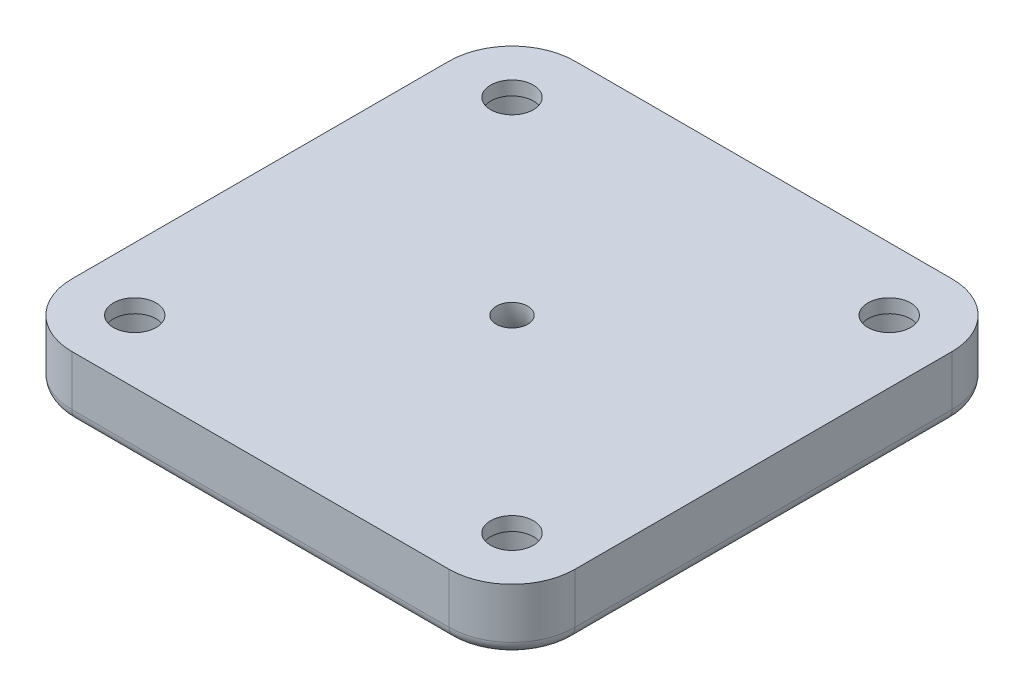
ISO-10303-21;
HEADER;
FILE_DESCRIPTION(('STEP AP214'),'2;1');
FILE_NAME('part.step','',(''),(''),'','','');
FILE_SCHEMA(('AUTOMOTIVE_DESIGN { 1 0 10303 214 1 1 1 1 }'));
ENDSEC;
DATA;
#1=APPLICATION_CONTEXT('core data for automotive mechanical design processes');
#2=APPLICATION_PROTOCOL_DEFINITION('international standard','automotive_design',2000,#1);
#3=PRODUCT_CONTEXT('',#1,'mechanical');
#4=PRODUCT('Part','Part','',(#3));
#5=PRODUCT_RELATED_PRODUCT_CATEGORY('part','',(#4));
#6=PRODUCT_DEFINITION_FORMATION('','',#4);
#7=PRODUCT_DEFINITION_CONTEXT('part definition',#1,'design');
#8=PRODUCT_DEFINITION('design','',#6,#7);
#9=PRODUCT_DEFINITION_SHAPE('','',#8);
#10=(LENGTH_UNIT() NAMED_UNIT(*) SI_UNIT(.MILLI.,.METRE.));
#11=(NAMED_UNIT(*) PLANE_ANGLE_UNIT() SI_UNIT($,.RADIAN.));
#12=(NAMED_UNIT(*) SI_UNIT($,.STERADIAN.) SOLID_ANGLE_UNIT());
#13=UNCERTAINTY_MEASURE_WITH_UNIT(LENGTH_MEASURE(1.E-05),#10,'distance_accuracy_value','');
#14=(GEOMETRIC_REPRESENTATION_CONTEXT(3) GLOBAL_UNCERTAINTY_ASSIGNED_CONTEXT((#13)) GLOBAL_UNIT_ASSIGNED_CONTEXT((#10,
#11,#12)) REPRESENTATION_CONTEXT('',''));
#15=CARTESIAN_POINT('',(0.,0.,0.));
#16=DIRECTION('',(0.,0.,1.));
#17=DIRECTION('',(1.,0.,0.));
#18=AXIS2_PLACEMENT_3D('',#15,#16,#17);
#19=CARTESIAN_POINT('',(-15.,-12.,15.));
#20=DIRECTION('',(0.,1.,0.));
#21=DIRECTION('',(0.,0.,1.));
#22=AXIS2_PLACEMENT_3D('',#19,#20,#21);
#23=CYLINDRICAL_SURFACE('',#22,1.7);
#24=CARTESIAN_POINT('',(-15.,-7.,15.));
#25=DIRECTION('',(0.,-1.,0.));
#26=DIRECTION('',(0.,0.,-1.));
#27=AXIS2_PLACEMENT_3D('',#24,#25,#26);
#28=CIRCLE('',#27,1.7);
#29=CARTESIAN_POINT('',(-15.,-7.,13.3));
#30=VERTEX_POINT('',#29);
#31=EDGE_CURVE('E143',#30,#30,#28,.T.);
#32=ORIENTED_EDGE('',*,*,#31,.F.);
#33=EDGE_LOOP('',(#32));
#34=FACE_BOUND('',#33,.T.);
#35=CARTESIAN_POINT('',(-15.,-8.1,15.));
#36=DIRECTION('',(0.,-1.,0.));
#37=DIRECTION('',(0.,0.,-1.));
#38=AXIS2_PLACEMENT_3D('',#35,#36,#37);
#39=CIRCLE('',#38,1.7);
#40=CARTESIAN_POINT('',(-15.,-8.1,13.3));
#41=VERTEX_POINT('',#40);
#42=EDGE_CURVE('E187',#41,#41,#39,.T.);
#43=ORIENTED_EDGE('',*,*,#42,.T.);
#44=EDGE_LOOP('',(#43));
#45=FACE_BOUND('',#44,.T.);
#46=ADVANCED_FACE('F33',(#34,#45),#23,.F.);
#47=CARTESIAN_POINT('',(15.,-12.,-15.));
#48=DIRECTION('',(0.,1.,0.));
#49=DIRECTION('',(0.,0.,1.));
#50=AXIS2_PLACEMENT_3D('',#47,#48,#49);
#51=CYLINDRICAL_SURFACE('',#50,1.7);
#52=CARTESIAN_POINT('',(15.,-7.,-15.));
#53=DIRECTION('',(0.,-1.,0.));
#54=DIRECTION('',(0.,0.,-1.));
#55=AXIS2_PLACEMENT_3D('',#52,#53,#54);
#56=CIRCLE('',#55,1.7);
#57=CARTESIAN_POINT('',(15.,-7.,-16.7));
#58=VERTEX_POINT('',#57);
#59=EDGE_CURVE('E274',#58,#58,#56,.T.);
#60=ORIENTED_EDGE('',*,*,#59,.F.);
#61=EDGE_LOOP('',(#60));
#62=FACE_BOUND('',#61,.T.);
#63=CARTESIAN_POINT('',(15.,-8.1,-15.));
#64=DIRECTION('',(0.,-1.,0.));
#65=DIRECTION('',(0.,0.,-1.));
#66=AXIS2_PLACEMENT_3D('',#63,#64,#65);
#67=CIRCLE('',#66,1.7);
#68=CARTESIAN_POINT('',(15.,-8.1,-16.7));
#69=VERTEX_POINT('',#68);
#70=EDGE_CURVE('E184',#69,#69,#67,.T.);
#71=ORIENTED_EDGE('',*,*,#70,.T.);
#72=EDGE_LOOP('',(#71));
#73=FACE_BOUND('',#72,.T.);
#74=ADVANCED_FACE('F290',(#62,#73),#51,.F.);
#75=CARTESIAN_POINT('',(-15.,-12.,-15.));
#76=DIRECTION('',(0.,1.,0.));
#77=DIRECTION('',(0.,0.,1.));
#78=AXIS2_PLACEMENT_3D('',#75,#76,#77);
#79=CYLINDRICAL_SURFACE('',#78,1.7);
#80=CARTESIAN_POINT('',(-15.,-7.,-15.));
#81=DIRECTION('',(0.,-1.,0.));
#82=DIRECTION('',(0.,0.,-1.));
#83=AXIS2_PLACEMENT_3D('',#80,#81,#82);
#84=CIRCLE('',#83,1.7);
#85=CARTESIAN_POINT('',(-15.,-7.,-16.7));
#86=VERTEX_POINT('',#85);
#87=EDGE_CURVE('E277',#86,#86,#84,.T.);
#88=ORIENTED_EDGE('',*,*,#87,.F.);
#89=EDGE_LOOP('',(#88));
#90=FACE_BOUND('',#89,.T.);
#91=CARTESIAN_POINT('',(-15.,-8.1,-15.));
#92=DIRECTION('',(0.,-1.,0.));
#93=DIRECTION('',(0.,0.,-1.));
#94=AXIS2_PLACEMENT_3D('',#91,#92,#93);
#95=CIRCLE('',#94,1.7);
#96=CARTESIAN_POINT('',(-15.,-8.1,-16.7));
#97=VERTEX_POINT('',#96);
#98=EDGE_CURVE('E180',#97,#97,#95,.T.);
#99=ORIENTED_EDGE('',*,*,#98,.T.);
#100=EDGE_LOOP('',(#99));
#101=FACE_BOUND('',#100,.T.);
#102=ADVANCED_FACE('F286',(#90,#101),#79,.F.);
#103=CARTESIAN_POINT('',(15.,-12.,15.));
#104=DIRECTION('',(0.,1.,0.));
#105=DIRECTION('',(0.,0.,1.));
#106=AXIS2_PLACEMENT_3D('',#103,#104,#105);
#107=CYLINDRICAL_SURFACE('',#106,1.7);
#108=CARTESIAN_POINT('',(15.,-7.,15.));
#109=DIRECTION('',(0.,-1.,0.));
#110=DIRECTION('',(0.,0.,-1.));
#111=AXIS2_PLACEMENT_3D('',#108,#109,#110);
#112=CIRCLE('',#111,1.7);
#113=CARTESIAN_POINT('',(15.,-7.,13.3));
#114=VERTEX_POINT('',#113);
#115=EDGE_CURVE('E146',#114,#114,#112,.T.);
#116=ORIENTED_EDGE('',*,*,#115,.F.);
#117=EDGE_LOOP('',(#116));
#118=FACE_BOUND('',#117,.T.);
#119=CARTESIAN_POINT('',(15.,-8.1,15.));
#120=DIRECTION('',(0.,-1.,0.));
#121=DIRECTION('',(0.,0.,-1.));
#122=AXIS2_PLACEMENT_3D('',#119,#120,#121);
#123=CIRCLE('',#122,1.7);
#124=CARTESIAN_POINT('',(15.,-8.1,13.3));
#125=VERTEX_POINT('',#124);
#126=EDGE_CURVE('E177',#125,#125,#123,.T.);
#127=ORIENTED_EDGE('',*,*,#126,.T.);
#128=EDGE_LOOP('',(#127));
#129=FACE_BOUND('',#128,.T.);
#130=ADVANCED_FACE('F289',(#118,#129),#107,.F.);
#131=CARTESIAN_POINT('',(15.,-12.,15.));
#132=DIRECTION('',(0.,1.,0.));
#133=DIRECTION('',(0.,0.,1.));
#134=AXIS2_PLACEMENT_3D('',#131,#132,#133);
#135=CYLINDRICAL_SURFACE('',#134,5.);
#136=DIRECTION('',(0.,1.,0.));
#137=VECTOR('',#136,1.);
#138=CARTESIAN_POINT('',(15.,-12.,20.));
#139=LINE('',#138,#137);
#140=CARTESIAN_POINT('',(15.,-11.,20.));
#141=VERTEX_POINT('',#140);
#142=CARTESIAN_POINT('',(15.,-7.,20.));
#143=VERTEX_POINT('',#142);
#144=EDGE_CURVE('E121',#141,#143,#139,.T.);
#145=ORIENTED_EDGE('',*,*,#144,.F.);
#146=CARTESIAN_POINT('',(15.,-11.,15.));
#147=DIRECTION('',(0.,-1.,0.));
#148=DIRECTION('',(0.,0.,-1.));
#149=AXIS2_PLACEMENT_3D('',#146,#147,#148);
#150=CIRCLE('',#149,5.);
#151=CARTESIAN_POINT('',(20.,-11.,15.));
#152=VERTEX_POINT('',#151);
#153=EDGE_CURVE('E42',#141,#152,#150,.F.);
#154=ORIENTED_EDGE('',*,*,#153,.T.);
#155=DIRECTION('',(0.,1.,0.));
#156=VECTOR('',#155,1.);
#157=CARTESIAN_POINT('',(20.,-12.,15.));
#158=LINE('',#157,#156);
#159=CARTESIAN_POINT('',(20.,-7.,15.));
#160=VERTEX_POINT('',#159);
#161=EDGE_CURVE('E141',#152,#160,#158,.T.);
#162=ORIENTED_EDGE('',*,*,#161,.T.);
#163=CARTESIAN_POINT('',(15.,-7.,15.));
#164=DIRECTION('',(0.,-1.,0.));
#165=DIRECTION('',(0.,0.,-1.));
#166=AXIS2_PLACEMENT_3D('',#163,#164,#165);
#167=CIRCLE('',#166,5.);
#168=EDGE_CURVE('E135',#160,#143,#167,.T.);
#169=ORIENTED_EDGE('',*,*,#168,.T.);
#170=EDGE_LOOP('',(#145,#154,#162,#169));
#171=FACE_BOUND('',#170,.T.);
#172=ADVANCED_FACE('F140',(#171),#135,.T.);
#173=CARTESIAN_POINT('',(15.,-12.,20.));
#174=DIRECTION('',(0.,0.,-1.));
#175=DIRECTION('',(-1.,0.,0.));
#176=AXIS2_PLACEMENT_3D('',#173,#174,#175);
#177=PLANE('',#176);
#178=DIRECTION('',(0.,1.,0.));
#179=VECTOR('',#178,1.);
#180=CARTESIAN_POINT('',(-15.,-12.,20.));
#181=LINE('',#180,#179);
#182=CARTESIAN_POINT('',(-15.,-11.,20.));
#183=VERTEX_POINT('',#182);
#184=CARTESIAN_POINT('',(-15.,-7.,20.));
#185=VERTEX_POINT('',#184);
#186=EDGE_CURVE('E129',#183,#185,#181,.T.);
#187=ORIENTED_EDGE('',*,*,#186,.F.);
#188=DIRECTION('',(-1.,0.,0.));
#189=VECTOR('',#188,1.);
#190=CARTESIAN_POINT('',(15.,-11.,20.));
#191=LINE('',#190,#189);
#192=EDGE_CURVE('E57',#183,#141,#191,.F.);
#193=ORIENTED_EDGE('',*,*,#192,.T.);
#194=ORIENTED_EDGE('',*,*,#144,.T.);
#195=DIRECTION('',(-1.,0.,0.));
#196=VECTOR('',#195,1.);
#197=CARTESIAN_POINT('',(15.,-7.,20.));
#198=LINE('',#197,#196);
#199=EDGE_CURVE('E124',#143,#185,#198,.T.);
#200=ORIENTED_EDGE('',*,*,#199,.T.);
#201=EDGE_LOOP('',(#187,#193,#194,#200));
#202=FACE_BOUND('',#201,.T.);
#203=ADVANCED_FACE('F123',(#202),#177,.F.);
#204=CARTESIAN_POINT('',(-15.,-12.,15.));
#205=DIRECTION('',(0.,1.,0.));
#206=DIRECTION('',(0.,0.,1.));
#207=AXIS2_PLACEMENT_3D('',#204,#205,#206);
#208=CYLINDRICAL_SURFACE('',#207,5.);
#209=DIRECTION('',(0.,1.,0.));
#210=VECTOR('',#209,1.);
#211=CARTESIAN_POINT('',(-20.,-12.,15.));
#212=LINE('',#211,#210);
#213=CARTESIAN_POINT('',(-20.,-11.,15.));
#214=VERTEX_POINT('',#213);
#215=CARTESIAN_POINT('',(-20.,-7.,15.));
#216=VERTEX_POINT('',#215);
#217=EDGE_CURVE('E174',#214,#216,#212,.T.);
#218=ORIENTED_EDGE('',*,*,#217,.F.);
#219=CARTESIAN_POINT('',(-15.,-11.,15.));
#220=DIRECTION('',(0.,-1.,0.));
#221=DIRECTION('',(0.,0.,-1.));
#222=AXIS2_PLACEMENT_3D('',#219,#220,#221);
#223=CIRCLE('',#222,5.);
#224=EDGE_CURVE('E219',#214,#183,#223,.F.);
#225=ORIENTED_EDGE('',*,*,#224,.T.);
#226=ORIENTED_EDGE('',*,*,#186,.T.);
#227=CARTESIAN_POINT('',(-15.,-7.,15.));
#228=DIRECTION('',(0.,-1.,0.));
#229=DIRECTION('',(0.,0.,-1.));
#230=AXIS2_PLACEMENT_3D('',#227,#228,#229);
#231=CIRCLE('',#230,5.);
#232=EDGE_CURVE('E138',#185,#216,#231,.T.);
#233=ORIENTED_EDGE('',*,*,#232,.T.);
#234=EDGE_LOOP('',(#218,#225,#226,#233));
#235=FACE_BOUND('',#234,.T.);
#236=ADVANCED_FACE('F368',(#235),#208,.T.);
#237=CARTESIAN_POINT('',(-20.,-12.,15.));
#238=DIRECTION('',(1.,0.,0.));
#239=DIRECTION('',(0.,0.,-1.));
#240=AXIS2_PLACEMENT_3D('',#237,#238,#239);
#241=PLANE('',#240);
#242=DIRECTION('',(0.,1.,0.));
#243=VECTOR('',#242,1.);
#244=CARTESIAN_POINT('',(-20.,-12.,-15.));
#245=LINE('',#244,#243);
#246=CARTESIAN_POINT('',(-20.,-11.,-15.));
#247=VERTEX_POINT('',#246);
#248=CARTESIAN_POINT('',(-20.,-7.,-15.));
#249=VERTEX_POINT('',#248);
#250=EDGE_CURVE('E172',#247,#249,#245,.T.);
#251=ORIENTED_EDGE('',*,*,#250,.F.);
#252=DIRECTION('',(0.,0.,-1.));
#253=VECTOR('',#252,1.);
#254=CARTESIAN_POINT('',(-20.,-11.,15.));
#255=LINE('',#254,#253);
#256=EDGE_CURVE('E217',#247,#214,#255,.F.);
#257=ORIENTED_EDGE('',*,*,#256,.T.);
#258=ORIENTED_EDGE('',*,*,#217,.T.);
#259=DIRECTION('',(0.,0.,-1.));
#260=VECTOR('',#259,1.);
#261=CARTESIAN_POINT('',(-20.,-7.,15.));
#262=LINE('',#261,#260);
#263=EDGE_CURVE('E151',#216,#249,#262,.T.);
#264=ORIENTED_EDGE('',*,*,#263,.T.);
#265=EDGE_LOOP('',(#251,#257,#258,#264));
#266=FACE_BOUND('',#265,.T.);
#267=ADVANCED_FACE('F364',(#266),#241,.F.);
#268=CARTESIAN_POINT('',(-15.,-12.,-15.));
#269=DIRECTION('',(0.,1.,0.));
#270=DIRECTION('',(0.,0.,1.));
#271=AXIS2_PLACEMENT_3D('',#268,#269,#270);
#272=CYLINDRICAL_SURFACE('',#271,5.);
#273=DIRECTION('',(0.,1.,0.));
#274=VECTOR('',#273,1.);
#275=CARTESIAN_POINT('',(-15.,-12.,-20.));
#276=LINE('',#275,#274);
#277=CARTESIAN_POINT('',(-15.,-11.,-20.));
#278=VERTEX_POINT('',#277);
#279=CARTESIAN_POINT('',(-15.,-7.,-20.));
#280=VERTEX_POINT('',#279);
#281=EDGE_CURVE('E170',#278,#280,#276,.T.);
#282=ORIENTED_EDGE('',*,*,#281,.F.);
#283=CARTESIAN_POINT('',(-15.,-11.,-15.));
#284=DIRECTION('',(0.,-1.,0.));
#285=DIRECTION('',(0.,0.,-1.));
#286=AXIS2_PLACEMENT_3D('',#283,#284,#285);
#287=CIRCLE('',#286,5.);
#288=EDGE_CURVE('E215',#278,#247,#287,.F.);
#289=ORIENTED_EDGE('',*,*,#288,.T.);
#290=ORIENTED_EDGE('',*,*,#250,.T.);
#291=CARTESIAN_POINT('',(-15.,-7.,-15.));
#292=DIRECTION('',(0.,-1.,0.));
#293=DIRECTION('',(0.,0.,-1.));
#294=AXIS2_PLACEMENT_3D('',#291,#292,#293);
#295=CIRCLE('',#294,5.);
#296=EDGE_CURVE('E154',#249,#280,#295,.T.);
#297=ORIENTED_EDGE('',*,*,#296,.T.);
#298=EDGE_LOOP('',(#282,#289,#290,#297));
#299=FACE_BOUND('',#298,.T.);
#300=ADVANCED_FACE('F360',(#299),#272,.T.);
#301=CARTESIAN_POINT('',(-15.,-12.,-20.));
#302=DIRECTION('',(0.,0.,1.));
#303=DIRECTION('',(1.,0.,0.));
#304=AXIS2_PLACEMENT_3D('',#301,#302,#303);
#305=PLANE('',#304);
#306=DIRECTION('',(0.,1.,0.));
#307=VECTOR('',#306,1.);
#308=CARTESIAN_POINT('',(15.,-12.,-20.));
#309=LINE('',#308,#307);
#310=CARTESIAN_POINT('',(15.,-11.,-20.));
#311=VERTEX_POINT('',#310);
#312=CARTESIAN_POINT('',(15.,-7.,-20.));
#313=VERTEX_POINT('',#312);
#314=EDGE_CURVE('E168',#311,#313,#309,.T.);
#315=ORIENTED_EDGE('',*,*,#314,.F.);
#316=DIRECTION('',(1.,0.,0.));
#317=VECTOR('',#316,1.);
#318=CARTESIAN_POINT('',(-15.,-11.,-20.));
#319=LINE('',#318,#317);
#320=EDGE_CURVE('E213',#311,#278,#319,.F.);
#321=ORIENTED_EDGE('',*,*,#320,.T.);
#322=ORIENTED_EDGE('',*,*,#281,.T.);
#323=DIRECTION('',(1.,0.,0.));
#324=VECTOR('',#323,1.);
#325=CARTESIAN_POINT('',(-15.,-7.,-20.));
#326=LINE('',#325,#324);
#327=EDGE_CURVE('E157',#280,#313,#326,.T.);
#328=ORIENTED_EDGE('',*,*,#327,.T.);
#329=EDGE_LOOP('',(#315,#321,#322,#328));
#330=FACE_BOUND('',#329,.T.);
#331=ADVANCED_FACE('F356',(#330),#305,.F.);
#332=CARTESIAN_POINT('',(15.,-12.,-15.));
#333=DIRECTION('',(0.,1.,0.));
#334=DIRECTION('',(0.,0.,1.));
#335=AXIS2_PLACEMENT_3D('',#332,#333,#334);
#336=CYLINDRICAL_SURFACE('',#335,5.);
#337=DIRECTION('',(0.,1.,0.));
#338=VECTOR('',#337,1.);
#339=CARTESIAN_POINT('',(20.,-12.,-15.));
#340=LINE('',#339,#338);
#341=CARTESIAN_POINT('',(20.,-11.,-15.));
#342=VERTEX_POINT('',#341);
#343=CARTESIAN_POINT('',(20.,-7.,-15.));
#344=VERTEX_POINT('',#343);
#345=EDGE_CURVE('E166',#342,#344,#340,.T.);
#346=ORIENTED_EDGE('',*,*,#345,.F.);
#347=CARTESIAN_POINT('',(15.,-11.,-15.));
#348=DIRECTION('',(0.,-1.,0.));
#349=DIRECTION('',(0.,0.,-1.));
#350=AXIS2_PLACEMENT_3D('',#347,#348,#349);
#351=CIRCLE('',#350,5.);
#352=EDGE_CURVE('E210',#342,#311,#351,.F.);
#353=ORIENTED_EDGE('',*,*,#352,.T.);
#354=ORIENTED_EDGE('',*,*,#314,.T.);
#355=CARTESIAN_POINT('',(15.,-7.,-15.));
#356=DIRECTION('',(0.,-1.,0.));
#357=DIRECTION('',(0.,0.,-1.));
#358=AXIS2_PLACEMENT_3D('',#355,#356,#357);
#359=CIRCLE('',#358,5.);
#360=EDGE_CURVE('E160',#313,#344,#359,.T.);
#361=ORIENTED_EDGE('',*,*,#360,.T.);
#362=EDGE_LOOP('',(#346,#353,#354,#361));
#363=FACE_BOUND('',#362,.T.);
#364=ADVANCED_FACE('F352',(#363),#336,.T.);
#365=CARTESIAN_POINT('',(20.,-12.,-15.));
#366=DIRECTION('',(-1.,0.,0.));
#367=DIRECTION('',(0.,0.,1.));
#368=AXIS2_PLACEMENT_3D('',#365,#366,#367);
#369=PLANE('',#368);
#370=ORIENTED_EDGE('',*,*,#161,.F.);
#371=DIRECTION('',(0.,0.,1.));
#372=VECTOR('',#371,1.);
#373=CARTESIAN_POINT('',(20.,-11.,-15.));
#374=LINE('',#373,#372);
#375=EDGE_CURVE('E11',#152,#342,#374,.F.);
#376=ORIENTED_EDGE('',*,*,#375,.T.);
#377=ORIENTED_EDGE('',*,*,#345,.T.);
#378=DIRECTION('',(0.,0.,1.));
#379=VECTOR('',#378,1.);
#380=CARTESIAN_POINT('',(20.,-7.,-15.));
#381=LINE('',#380,#379);
#382=EDGE_CURVE('E163',#344,#160,#381,.T.);
#383=ORIENTED_EDGE('',*,*,#382,.T.);
#384=EDGE_LOOP('',(#370,#376,#377,#383));
#385=FACE_BOUND('',#384,.T.);
#386=ADVANCED_FACE('F311',(#385),#369,.F.);
#387=CARTESIAN_POINT('',(15.,-12.,15.));
#388=DIRECTION('',(0.,-1.,0.));
#389=DIRECTION('',(0.,0.,-1.));
#390=AXIS2_PLACEMENT_3D('',#387,#388,#389);
#391=PLANE('',#390);
#392=DIRECTION('',(1.,0.,0.));
#393=VECTOR('',#392,1.);
#394=CARTESIAN_POINT('',(15.,-12.,-19.));
#395=LINE('',#394,#393);
#396=CARTESIAN_POINT('',(-15.,-12.,-19.));
#397=VERTEX_POINT('',#396);
#398=CARTESIAN_POINT('',(15.,-12.,-19.));
#399=VERTEX_POINT('',#398);
#400=EDGE_CURVE('E205',#397,#399,#395,.T.);
#401=ORIENTED_EDGE('',*,*,#400,.T.);
#402=CARTESIAN_POINT('',(15.,-12.,-15.));
#403=DIRECTION('',(0.,-1.,0.));
#404=DIRECTION('',(0.,0.,-1.));
#405=AXIS2_PLACEMENT_3D('',#402,#403,#404);
#406=CIRCLE('',#405,4.);
#407=CARTESIAN_POINT('',(19.,-12.,-15.));
#408=VERTEX_POINT('',#407);
#409=EDGE_CURVE('E207',#399,#408,#406,.T.);
#410=ORIENTED_EDGE('',*,*,#409,.T.);
#411=DIRECTION('',(0.,0.,1.));
#412=VECTOR('',#411,1.);
#413=CARTESIAN_POINT('',(19.,-12.,15.));
#414=LINE('',#413,#412);
#415=CARTESIAN_POINT('',(19.,-12.,15.));
#416=VERTEX_POINT('',#415);
#417=EDGE_CURVE('E193',#408,#416,#414,.T.);
#418=ORIENTED_EDGE('',*,*,#417,.T.);
#419=CARTESIAN_POINT('',(15.,-12.,15.));
#420=DIRECTION('',(0.,-1.,0.));
#421=DIRECTION('',(0.,0.,-1.));
#422=AXIS2_PLACEMENT_3D('',#419,#420,#421);
#423=CIRCLE('',#422,4.);
#424=CARTESIAN_POINT('',(15.,-12.,19.));
#425=VERTEX_POINT('',#424);
#426=EDGE_CURVE('E195',#416,#425,#423,.T.);
#427=ORIENTED_EDGE('',*,*,#426,.T.);
#428=DIRECTION('',(-1.,0.,0.));
#429=VECTOR('',#428,1.);
#430=CARTESIAN_POINT('',(-15.,-12.,19.));
#431=LINE('',#430,#429);
#432=CARTESIAN_POINT('',(-15.,-12.,19.));
#433=VERTEX_POINT('',#432);
#434=EDGE_CURVE('E197',#425,#433,#431,.T.);
#435=ORIENTED_EDGE('',*,*,#434,.T.);
#436=CARTESIAN_POINT('',(-15.,-12.,15.));
#437=DIRECTION('',(0.,-1.,0.));
#438=DIRECTION('',(0.,0.,-1.));
#439=AXIS2_PLACEMENT_3D('',#436,#437,#438);
#440=CIRCLE('',#439,4.);
#441=CARTESIAN_POINT('',(-19.,-12.,15.));
#442=VERTEX_POINT('',#441);
#443=EDGE_CURVE('E199',#433,#442,#440,.T.);
#444=ORIENTED_EDGE('',*,*,#443,.T.);
#445=DIRECTION('',(0.,0.,-1.));
#446=VECTOR('',#445,1.);
#447=CARTESIAN_POINT('',(-19.,-12.,-15.));
#448=LINE('',#447,#446);
#449=CARTESIAN_POINT('',(-19.,-12.,-15.));
#450=VERTEX_POINT('',#449);
#451=EDGE_CURVE('E201',#442,#450,#448,.T.);
#452=ORIENTED_EDGE('',*,*,#451,.T.);
#453=CARTESIAN_POINT('',(-15.,-12.,-15.));
#454=DIRECTION('',(0.,-1.,0.));
#455=DIRECTION('',(0.,0.,-1.));
#456=AXIS2_PLACEMENT_3D('',#453,#454,#455);
#457=CIRCLE('',#456,4.);
#458=EDGE_CURVE('E203',#450,#397,#457,.T.);
#459=ORIENTED_EDGE('',*,*,#458,.T.);
#460=EDGE_LOOP('',(#401,#410,#418,#427,#435,#444,#452,#459));
#461=FACE_BOUND('',#460,.T.);
#462=CARTESIAN_POINT('',(0.,-12.,0.));
#463=DIRECTION('',(0.,-1.,0.));
#464=DIRECTION('',(0.,0.,-1.));
#465=AXIS2_PLACEMENT_3D('',#462,#463,#464);
#466=CIRCLE('',#465,6.25);
#467=CARTESIAN_POINT('',(0.,-12.,-6.25));
#468=VERTEX_POINT('',#467);
#469=EDGE_CURVE('E128',#468,#468,#466,.F.);
#470=ORIENTED_EDGE('',*,*,#469,.T.);
#471=EDGE_LOOP('',(#470));
#472=FACE_BOUND('',#471,.T.);
#473=CARTESIAN_POINT('',(15.,-12.,15.));
#474=DIRECTION('',(0.,-1.,0.));
#475=DIRECTION('',(0.,0.,-1.));
#476=AXIS2_PLACEMENT_3D('',#473,#474,#475);
#477=CIRCLE('',#476,2.6);
#478=CARTESIAN_POINT('',(15.,-12.,12.4));
#479=VERTEX_POINT('',#478);
#480=EDGE_CURVE('E261',#479,#479,#477,.T.);
#481=ORIENTED_EDGE('',*,*,#480,.F.);
#482=EDGE_LOOP('',(#481));
#483=FACE_BOUND('',#482,.T.);
#484=CARTESIAN_POINT('',(-15.,-12.,-15.));
#485=DIRECTION('',(0.,-1.,0.));
#486=DIRECTION('',(0.,0.,-1.));
#487=AXIS2_PLACEMENT_3D('',#484,#485,#486);
#488=CIRCLE('',#487,2.6);
#489=CARTESIAN_POINT('',(-15.,-12.,-17.6));
#490=VERTEX_POINT('',#489);
#491=EDGE_CURVE('E262',#490,#490,#488,.T.);
#492=ORIENTED_EDGE('',*,*,#491,.F.);
#493=EDGE_LOOP('',(#492));
#494=FACE_BOUND('',#493,.T.);
#495=CARTESIAN_POINT('',(15.,-12.,-15.));
#496=DIRECTION('',(0.,-1.,0.));
#497=DIRECTION('',(0.,0.,-1.));
#498=AXIS2_PLACEMENT_3D('',#495,#496,#497);
#499=CIRCLE('',#498,2.6);
#500=CARTESIAN_POINT('',(15.,-12.,-17.6));
#501=VERTEX_POINT('',#500);
#502=EDGE_CURVE('E250',#501,#501,#499,.T.);
#503=ORIENTED_EDGE('',*,*,#502,.F.);
#504=EDGE_LOOP('',(#503));
#505=FACE_BOUND('',#504,.T.);
#506=CARTESIAN_POINT('',(-15.,-12.,15.));
#507=DIRECTION('',(0.,-1.,0.));
#508=DIRECTION('',(0.,0.,-1.));
#509=AXIS2_PLACEMENT_3D('',#506,#507,#508);
#510=CIRCLE('',#509,2.6);
#511=CARTESIAN_POINT('',(-15.,-12.,12.4));
#512=VERTEX_POINT('',#511);
#513=EDGE_CURVE('E265',#512,#512,#510,.T.);
#514=ORIENTED_EDGE('',*,*,#513,.F.);
#515=EDGE_LOOP('',(#514));
#516=FACE_BOUND('',#515,.T.);
#517=ADVANCED_FACE('F308',(#461,#472,#483,#494,#505,#516),#391,.T.);
#518=CARTESIAN_POINT('',(15.,-7.,15.));
#519=DIRECTION('',(0.,-1.,0.));
#520=DIRECTION('',(0.,0.,-1.));
#521=AXIS2_PLACEMENT_3D('',#518,#519,#520);
#522=PLANE('',#521);
#523=ORIENTED_EDGE('',*,*,#115,.T.);
#524=EDGE_LOOP('',(#523));
#525=FACE_BOUND('',#524,.T.);
#526=ORIENTED_EDGE('',*,*,#87,.T.);
#527=EDGE_LOOP('',(#526));
#528=FACE_BOUND('',#527,.T.);
#529=ORIENTED_EDGE('',*,*,#59,.T.);
#530=EDGE_LOOP('',(#529));
#531=FACE_BOUND('',#530,.T.);
#532=CARTESIAN_POINT('',(0.,-7.,0.));
#533=DIRECTION('',(0.,-1.,0.));
#534=DIRECTION('',(0.,0.,-1.));
#535=AXIS2_PLACEMENT_3D('',#532,#533,#534);
#536=CIRCLE('',#535,1.25);
#537=CARTESIAN_POINT('',(0.,-7.,-1.25));
#538=VERTEX_POINT('',#537);
#539=EDGE_CURVE('E190',#538,#538,#536,.T.);
#540=ORIENTED_EDGE('',*,*,#539,.T.);
#541=EDGE_LOOP('',(#540));
#542=FACE_BOUND('',#541,.T.);
#543=ORIENTED_EDGE('',*,*,#31,.T.);
#544=EDGE_LOOP('',(#543));
#545=FACE_BOUND('',#544,.T.);
#546=ORIENTED_EDGE('',*,*,#168,.F.);
#547=ORIENTED_EDGE('',*,*,#382,.F.);
#548=ORIENTED_EDGE('',*,*,#360,.F.);
#549=ORIENTED_EDGE('',*,*,#327,.F.);
#550=ORIENTED_EDGE('',*,*,#296,.F.);
#551=ORIENTED_EDGE('',*,*,#263,.F.);
#552=ORIENTED_EDGE('',*,*,#232,.F.);
#553=ORIENTED_EDGE('',*,*,#199,.F.);
#554=EDGE_LOOP('',(#546,#547,#548,#549,#550,#551,#552,#553));
#555=FACE_BOUND('',#554,.T.);
#556=ADVANCED_FACE('F133',(#525,#528,#531,#542,#545,#555),#522,.F.);
#557=CARTESIAN_POINT('',(15.,-12.,15.));
#558=DIRECTION('',(0.,-1.,0.));
#559=DIRECTION('',(0.,0.,-1.));
#560=AXIS2_PLACEMENT_3D('',#557,#558,#559);
#561=CONICAL_SURFACE('',#560,2.6,0.026179938779915);
#562=CARTESIAN_POINT('',(15.,-8.1,15.));
#563=DIRECTION('',(0.,-1.,0.));
#564=DIRECTION('',(0.,0.,-1.));
#565=AXIS2_PLACEMENT_3D('',#562,#563,#564);
#566=CIRCLE('',#565,2.49787490588017);
#567=CARTESIAN_POINT('',(15.,-8.1,12.5021250941198));
#568=VERTEX_POINT('',#567);
#569=EDGE_CURVE('E258',#568,#568,#566,.T.);
#570=ORIENTED_EDGE('',*,*,#569,.F.);
#571=EDGE_LOOP('',(#570));
#572=FACE_BOUND('',#571,.T.);
#573=ORIENTED_EDGE('',*,*,#480,.T.);
#574=EDGE_LOOP('',(#573));
#575=FACE_BOUND('',#574,.T.);
#576=ADVANCED_FACE('F348',(#572,#575),#561,.F.);
#577=CARTESIAN_POINT('',(15.,-8.1,15.));
#578=DIRECTION('',(0.,-1.,0.));
#579=DIRECTION('',(0.,0.,-1.));
#580=AXIS2_PLACEMENT_3D('',#577,#578,#579);
#581=PLANE('',#580);
#582=ORIENTED_EDGE('',*,*,#126,.F.);
#583=EDGE_LOOP('',(#582));
#584=FACE_BOUND('',#583,.T.);
#585=ORIENTED_EDGE('',*,*,#569,.T.);
#586=EDGE_LOOP('',(#585));
#587=FACE_BOUND('',#586,.T.);
#588=ADVANCED_FACE('F304',(#584,#587),#581,.T.);
#589=CARTESIAN_POINT('',(-15.,-12.,-15.));
#590=DIRECTION('',(0.,-1.,0.));
#591=DIRECTION('',(0.,0.,-1.));
#592=AXIS2_PLACEMENT_3D('',#589,#590,#591);
#593=CONICAL_SURFACE('',#592,2.6,0.026179938779915);
#594=CARTESIAN_POINT('',(-15.,-8.1,-15.));
#595=DIRECTION('',(0.,-1.,0.));
#596=DIRECTION('',(0.,0.,-1.));
#597=AXIS2_PLACEMENT_3D('',#594,#595,#596);
#598=CIRCLE('',#597,2.49787490588017);
#599=CARTESIAN_POINT('',(-15.,-8.1,-17.4978749058802));
#600=VERTEX_POINT('',#599);
#601=EDGE_CURVE('E255',#600,#600,#598,.T.);
#602=ORIENTED_EDGE('',*,*,#601,.F.);
#603=EDGE_LOOP('',(#602));
#604=FACE_BOUND('',#603,.T.);
#605=ORIENTED_EDGE('',*,*,#491,.T.);
#606=EDGE_LOOP('',(#605));
#607=FACE_BOUND('',#606,.T.);
#608=ADVANCED_FACE('F298',(#604,#607),#593,.F.);
#609=CARTESIAN_POINT('',(-15.,-8.1,-15.));
#610=DIRECTION('',(0.,-1.,0.));
#611=DIRECTION('',(0.,0.,-1.));
#612=AXIS2_PLACEMENT_3D('',#609,#610,#611);
#613=PLANE('',#612);
#614=ORIENTED_EDGE('',*,*,#98,.F.);
#615=EDGE_LOOP('',(#614));
#616=FACE_BOUND('',#615,.T.);
#617=ORIENTED_EDGE('',*,*,#601,.T.);
#618=EDGE_LOOP('',(#617));
#619=FACE_BOUND('',#618,.T.);
#620=ADVANCED_FACE('F294',(#616,#619),#613,.T.);
#621=CARTESIAN_POINT('',(15.,-12.,-15.));
#622=DIRECTION('',(0.,-1.,0.));
#623=DIRECTION('',(0.,0.,-1.));
#624=AXIS2_PLACEMENT_3D('',#621,#622,#623);
#625=CONICAL_SURFACE('',#624,2.6,0.026179938779915);
#626=CARTESIAN_POINT('',(15.,-8.1,-15.));
#627=DIRECTION('',(0.,-1.,0.));
#628=DIRECTION('',(0.,0.,-1.));
#629=AXIS2_PLACEMENT_3D('',#626,#627,#628);
#630=CIRCLE('',#629,2.49787490588017);
#631=CARTESIAN_POINT('',(15.,-8.1,-17.4978749058802));
#632=VERTEX_POINT('',#631);
#633=EDGE_CURVE('E244',#632,#632,#630,.T.);
#634=ORIENTED_EDGE('',*,*,#633,.F.);
#635=EDGE_LOOP('',(#634));
#636=FACE_BOUND('',#635,.T.);
#637=ORIENTED_EDGE('',*,*,#502,.T.);
#638=EDGE_LOOP('',(#637));
#639=FACE_BOUND('',#638,.T.);
#640=ADVANCED_FACE('F297',(#636,#639),#625,.F.);
#641=CARTESIAN_POINT('',(15.,-8.1,-15.));
#642=DIRECTION('',(0.,-1.,0.));
#643=DIRECTION('',(0.,0.,-1.));
#644=AXIS2_PLACEMENT_3D('',#641,#642,#643);
#645=PLANE('',#644);
#646=ORIENTED_EDGE('',*,*,#70,.F.);
#647=EDGE_LOOP('',(#646));
#648=FACE_BOUND('',#647,.T.);
#649=ORIENTED_EDGE('',*,*,#633,.T.);
#650=EDGE_LOOP('',(#649));
#651=FACE_BOUND('',#650,.T.);
#652=ADVANCED_FACE('F321',(#648,#651),#645,.T.);
#653=CARTESIAN_POINT('',(-15.,-12.,15.));
#654=DIRECTION('',(0.,-1.,0.));
#655=DIRECTION('',(0.,0.,-1.));
#656=AXIS2_PLACEMENT_3D('',#653,#654,#655);
#657=CONICAL_SURFACE('',#656,2.6,0.026179938779915);
#658=CARTESIAN_POINT('',(-15.,-8.1,15.));
#659=DIRECTION('',(0.,-1.,0.));
#660=DIRECTION('',(0.,0.,-1.));
#661=AXIS2_PLACEMENT_3D('',#658,#659,#660);
#662=CIRCLE('',#661,2.49787490588017);
#663=CARTESIAN_POINT('',(-15.,-8.1,12.5021250941198));
#664=VERTEX_POINT('',#663);
#665=EDGE_CURVE('E181',#664,#664,#662,.T.);
#666=ORIENTED_EDGE('',*,*,#665,.F.);
#667=EDGE_LOOP('',(#666));
#668=FACE_BOUND('',#667,.T.);
#669=ORIENTED_EDGE('',*,*,#513,.T.);
#670=EDGE_LOOP('',(#669));
#671=FACE_BOUND('',#670,.T.);
#672=ADVANCED_FACE('F318',(#668,#671),#657,.F.);
#673=CARTESIAN_POINT('',(-15.,-8.1,15.));
#674=DIRECTION('',(0.,-1.,0.));
#675=DIRECTION('',(0.,0.,-1.));
#676=AXIS2_PLACEMENT_3D('',#673,#674,#675);
#677=PLANE('',#676);
#678=ORIENTED_EDGE('',*,*,#42,.F.);
#679=EDGE_LOOP('',(#678));
#680=FACE_BOUND('',#679,.T.);
#681=ORIENTED_EDGE('',*,*,#665,.T.);
#682=EDGE_LOOP('',(#681));
#683=FACE_BOUND('',#682,.T.);
#684=ADVANCED_FACE('F320',(#680,#683),#677,.T.);
#685=CARTESIAN_POINT('',(0.,-7.,0.));
#686=DIRECTION('',(0.,-1.,0.));
#687=DIRECTION('',(0.,0.,-1.));
#688=AXIS2_PLACEMENT_3D('',#685,#686,#687);
#689=TOROIDAL_SURFACE('',#688,6.25,5.);
#690=ORIENTED_EDGE('',*,*,#469,.F.);
#691=EDGE_LOOP('',(#690));
#692=FACE_BOUND('',#691,.T.);
#693=ORIENTED_EDGE('',*,*,#539,.F.);
#694=EDGE_LOOP('',(#693));
#695=FACE_BOUND('',#694,.T.);
#696=ADVANCED_FACE('F328',(#692,#695),#689,.T.);
#697=CARTESIAN_POINT('',(-15.,-11.,15.));
#698=DIRECTION('',(0.,-1.,0.));
#699=DIRECTION('',(0.,0.,-1.));
#700=AXIS2_PLACEMENT_3D('',#697,#698,#699);
#701=TOROIDAL_SURFACE('',#700,4.,1.);
#702=CARTESIAN_POINT('',(-15.,-11.,19.));
#703=DIRECTION('',(1.,0.,0.));
#704=DIRECTION('',(0.,0.,-1.));
#705=AXIS2_PLACEMENT_3D('',#702,#703,#704);
#706=CIRCLE('',#705,1.);
#707=EDGE_CURVE('E238',#183,#433,#706,.T.);
#708=ORIENTED_EDGE('',*,*,#707,.F.);
#709=ORIENTED_EDGE('',*,*,#224,.F.);
#710=CARTESIAN_POINT('',(-19.,-11.,15.));
#711=DIRECTION('',(0.,0.,-1.));
#712=DIRECTION('',(-1.,0.,0.));
#713=AXIS2_PLACEMENT_3D('',#710,#711,#712);
#714=CIRCLE('',#713,1.);
#715=EDGE_CURVE('E37',#442,#214,#714,.T.);
#716=ORIENTED_EDGE('',*,*,#715,.F.);
#717=ORIENTED_EDGE('',*,*,#443,.F.);
#718=EDGE_LOOP('',(#708,#709,#716,#717));
#719=FACE_BOUND('',#718,.T.);
#720=ADVANCED_FACE('F35',(#719),#701,.T.);
#721=CARTESIAN_POINT('',(-19.,-11.,15.));
#722=DIRECTION('',(0.,0.,1.));
#723=DIRECTION('',(1.,0.,0.));
#724=AXIS2_PLACEMENT_3D('',#721,#722,#723);
#725=CYLINDRICAL_SURFACE('',#724,1.);
#726=ORIENTED_EDGE('',*,*,#715,.T.);
#727=ORIENTED_EDGE('',*,*,#256,.F.);
#728=CARTESIAN_POINT('',(-19.,-11.,-15.));
#729=DIRECTION('',(0.,0.,-1.));
#730=DIRECTION('',(-1.,0.,0.));
#731=AXIS2_PLACEMENT_3D('',#728,#729,#730);
#732=CIRCLE('',#731,1.);
#733=EDGE_CURVE('E236',#450,#247,#732,.T.);
#734=ORIENTED_EDGE('',*,*,#733,.F.);
#735=ORIENTED_EDGE('',*,*,#451,.F.);
#736=EDGE_LOOP('',(#726,#727,#734,#735));
#737=FACE_BOUND('',#736,.T.);
#738=ADVANCED_FACE('F402',(#737),#725,.T.);
#739=CARTESIAN_POINT('',(15.,-11.,19.));
#740=DIRECTION('',(1.,0.,0.));
#741=DIRECTION('',(0.,0.,-1.));
#742=AXIS2_PLACEMENT_3D('',#739,#740,#741);
#743=CYLINDRICAL_SURFACE('',#742,1.);
#744=ORIENTED_EDGE('',*,*,#707,.T.);
#745=ORIENTED_EDGE('',*,*,#434,.F.);
#746=CARTESIAN_POINT('',(15.,-11.,19.));
#747=DIRECTION('',(1.,0.,0.));
#748=DIRECTION('',(0.,0.,-1.));
#749=AXIS2_PLACEMENT_3D('',#746,#747,#748);
#750=CIRCLE('',#749,1.);
#751=EDGE_CURVE('E233',#141,#425,#750,.T.);
#752=ORIENTED_EDGE('',*,*,#751,.F.);
#753=ORIENTED_EDGE('',*,*,#192,.F.);
#754=EDGE_LOOP('',(#744,#745,#752,#753));
#755=FACE_BOUND('',#754,.T.);
#756=ADVANCED_FACE('F399',(#755),#743,.T.);
#757=CARTESIAN_POINT('',(-15.,-11.,-15.));
#758=DIRECTION('',(0.,-1.,0.));
#759=DIRECTION('',(0.,0.,-1.));
#760=AXIS2_PLACEMENT_3D('',#757,#758,#759);
#761=TOROIDAL_SURFACE('',#760,4.,1.);
#762=ORIENTED_EDGE('',*,*,#733,.T.);
#763=ORIENTED_EDGE('',*,*,#288,.F.);
#764=CARTESIAN_POINT('',(-15.,-11.,-19.));
#765=DIRECTION('',(1.,0.,0.));
#766=DIRECTION('',(0.,0.,-1.));
#767=AXIS2_PLACEMENT_3D('',#764,#765,#766);
#768=CIRCLE('',#767,1.);
#769=EDGE_CURVE('E230',#397,#278,#768,.T.);
#770=ORIENTED_EDGE('',*,*,#769,.F.);
#771=ORIENTED_EDGE('',*,*,#458,.F.);
#772=EDGE_LOOP('',(#762,#763,#770,#771));
#773=FACE_BOUND('',#772,.T.);
#774=ADVANCED_FACE('F395',(#773),#761,.T.);
#775=CARTESIAN_POINT('',(15.,-11.,15.));
#776=DIRECTION('',(0.,-1.,0.));
#777=DIRECTION('',(0.,0.,-1.));
#778=AXIS2_PLACEMENT_3D('',#775,#776,#777);
#779=TOROIDAL_SURFACE('',#778,4.,1.);
#780=ORIENTED_EDGE('',*,*,#751,.T.);
#781=ORIENTED_EDGE('',*,*,#426,.F.);
#782=CARTESIAN_POINT('',(19.,-11.,15.));
#783=DIRECTION('',(0.,0.,-1.));
#784=DIRECTION('',(-1.,0.,0.));
#785=AXIS2_PLACEMENT_3D('',#782,#783,#784);
#786=CIRCLE('',#785,1.);
#787=EDGE_CURVE('E227',#152,#416,#786,.T.);
#788=ORIENTED_EDGE('',*,*,#787,.F.);
#789=ORIENTED_EDGE('',*,*,#153,.F.);
#790=EDGE_LOOP('',(#780,#781,#788,#789));
#791=FACE_BOUND('',#790,.T.);
#792=ADVANCED_FACE('F391',(#791),#779,.T.);
#793=CARTESIAN_POINT('',(15.,-11.,-19.));
#794=DIRECTION('',(-1.,0.,0.));
#795=DIRECTION('',(0.,0.,1.));
#796=AXIS2_PLACEMENT_3D('',#793,#794,#795);
#797=CYLINDRICAL_SURFACE('',#796,1.);
#798=ORIENTED_EDGE('',*,*,#769,.T.);
#799=ORIENTED_EDGE('',*,*,#320,.F.);
#800=CARTESIAN_POINT('',(15.,-11.,-19.));
#801=DIRECTION('',(1.,0.,0.));
#802=DIRECTION('',(0.,0.,-1.));
#803=AXIS2_PLACEMENT_3D('',#800,#801,#802);
#804=CIRCLE('',#803,1.);
#805=EDGE_CURVE('E225',#399,#311,#804,.T.);
#806=ORIENTED_EDGE('',*,*,#805,.F.);
#807=ORIENTED_EDGE('',*,*,#400,.F.);
#808=EDGE_LOOP('',(#798,#799,#806,#807));
#809=FACE_BOUND('',#808,.T.);
#810=ADVANCED_FACE('F387',(#809),#797,.T.);
#811=CARTESIAN_POINT('',(19.,-11.,15.));
#812=DIRECTION('',(0.,0.,-1.));
#813=DIRECTION('',(-1.,0.,0.));
#814=AXIS2_PLACEMENT_3D('',#811,#812,#813);
#815=CYLINDRICAL_SURFACE('',#814,1.);
#816=ORIENTED_EDGE('',*,*,#787,.T.);
#817=ORIENTED_EDGE('',*,*,#417,.F.);
#818=CARTESIAN_POINT('',(19.,-11.,-15.));
#819=DIRECTION('',(0.,0.,-1.));
#820=DIRECTION('',(-1.,0.,0.));
#821=AXIS2_PLACEMENT_3D('',#818,#819,#820);
#822=CIRCLE('',#821,1.);
#823=EDGE_CURVE('E223',#342,#408,#822,.T.);
#824=ORIENTED_EDGE('',*,*,#823,.F.);
#825=ORIENTED_EDGE('',*,*,#375,.F.);
#826=EDGE_LOOP('',(#816,#817,#824,#825));
#827=FACE_BOUND('',#826,.T.);
#828=ADVANCED_FACE('F383',(#827),#815,.T.);
#829=CARTESIAN_POINT('',(15.,-11.,-15.));
#830=DIRECTION('',(0.,-1.,0.));
#831=DIRECTION('',(0.,0.,-1.));
#832=AXIS2_PLACEMENT_3D('',#829,#830,#831);
#833=TOROIDAL_SURFACE('',#832,4.,1.);
#834=ORIENTED_EDGE('',*,*,#805,.T.);
#835=ORIENTED_EDGE('',*,*,#352,.F.);
#836=ORIENTED_EDGE('',*,*,#823,.T.);
#837=ORIENTED_EDGE('',*,*,#409,.F.);
#838=EDGE_LOOP('',(#834,#835,#836,#837));
#839=FACE_BOUND('',#838,.T.);
#840=ADVANCED_FACE('F380',(#839),#833,.T.);
#841=CLOSED_SHELL('',(#46,#74,#102,#130,#172,#203,#236,#267,#300,#331,#364,#386,#517,#556,#576,
#588,#608,#620,#640,#652,#672,#684,#696,#720,#738,#756,#774,#792,#810,#828,#840));
#842=MANIFOLD_SOLID_BREP('B2',#841);
#843=ADVANCED_BREP_SHAPE_REPRESENTATION('',(#18,#842),#14);
#844=SHAPE_DEFINITION_REPRESENTATION(#9,#843);
ENDSEC;
END-ISO-10303-21;
